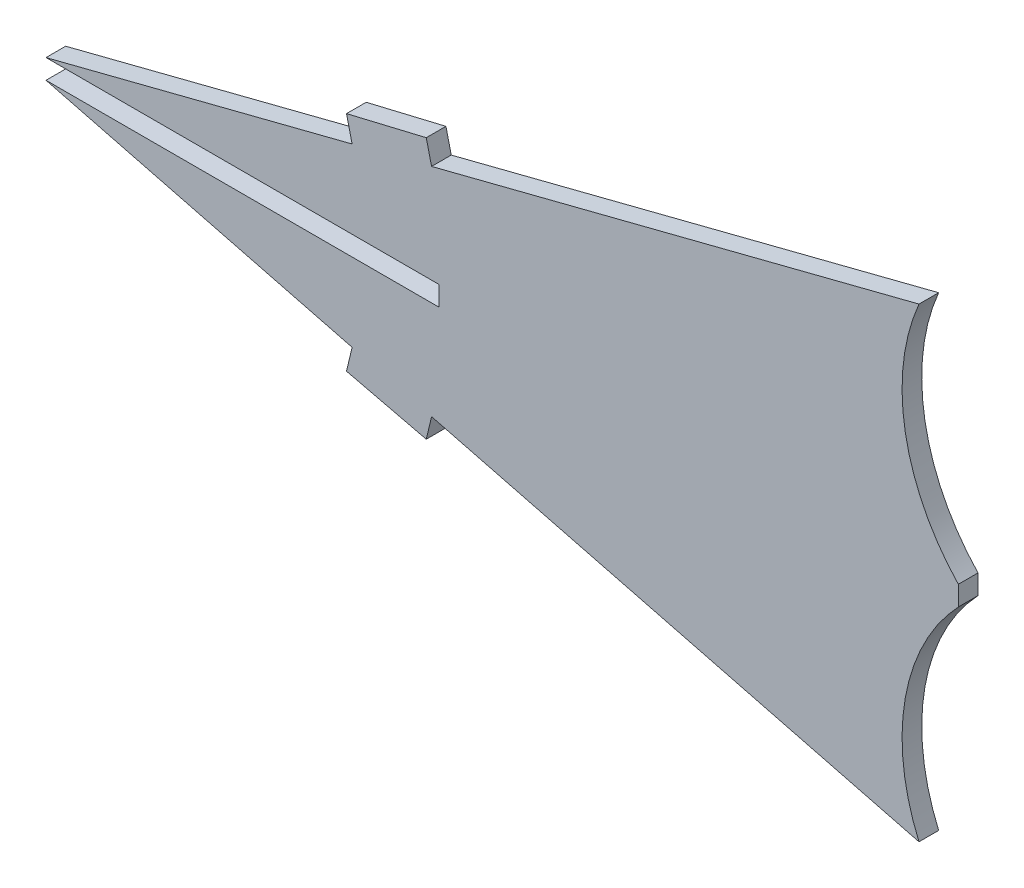
ISO-10303-21;
HEADER;
FILE_DESCRIPTION(('STEP AP214'),'2;1');
FILE_NAME('part.step','',(''),(''),'','','');
FILE_SCHEMA(('AUTOMOTIVE_DESIGN { 1 0 10303 214 1 1 1 1 }'));
ENDSEC;
DATA;
#1=APPLICATION_CONTEXT('core data for automotive mechanical design processes');
#2=APPLICATION_PROTOCOL_DEFINITION('international standard','automotive_design',2000,#1);
#3=PRODUCT_CONTEXT('',#1,'mechanical');
#4=PRODUCT('Part','Part','',(#3));
#5=PRODUCT_RELATED_PRODUCT_CATEGORY('part','',(#4));
#6=PRODUCT_DEFINITION_FORMATION('','',#4);
#7=PRODUCT_DEFINITION_CONTEXT('part definition',#1,'design');
#8=PRODUCT_DEFINITION('design','',#6,#7);
#9=PRODUCT_DEFINITION_SHAPE('','',#8);
#10=(LENGTH_UNIT() NAMED_UNIT(*) SI_UNIT(.MILLI.,.METRE.));
#11=(NAMED_UNIT(*) PLANE_ANGLE_UNIT() SI_UNIT($,.RADIAN.));
#12=(NAMED_UNIT(*) SI_UNIT($,.STERADIAN.) SOLID_ANGLE_UNIT());
#13=UNCERTAINTY_MEASURE_WITH_UNIT(LENGTH_MEASURE(1.E-05),#10,'distance_accuracy_value','');
#14=(GEOMETRIC_REPRESENTATION_CONTEXT(3) GLOBAL_UNCERTAINTY_ASSIGNED_CONTEXT((#13)) GLOBAL_UNIT_ASSIGNED_CONTEXT((#10,
#11,#12)) REPRESENTATION_CONTEXT('',''));
#15=CARTESIAN_POINT('',(0.,0.,0.));
#16=DIRECTION('',(0.,0.,1.));
#17=DIRECTION('',(1.,0.,0.));
#18=AXIS2_PLACEMENT_3D('',#15,#16,#17);
#19=CARTESIAN_POINT('',(119.605645903194,-1.52399999999689,1.524));
#20=DIRECTION('',(-1.02331121256464E-13,-1.,0.));
#21=DIRECTION('',(1.,-1.02331121256464E-13,0.));
#22=AXIS2_PLACEMENT_3D('',#19,#20,#21);
#23=PLANE('',#22);
#24=DIRECTION('',(-1.,1.02331121256464E-13,0.));
#25=VECTOR('',#24,1.);
#26=CARTESIAN_POINT('',(119.605645903194,-1.52399999999689,0.));
#27=LINE('',#26,#25);
#28=CARTESIAN_POINT('',(150.036715567802,-1.524,0.));
#29=VERTEX_POINT('',#28);
#30=CARTESIAN_POINT('',(119.605645903194,-1.52399999999689,0.));
#31=VERTEX_POINT('',#30);
#32=EDGE_CURVE('E185',#29,#31,#27,.T.);
#33=ORIENTED_EDGE('',*,*,#32,.T.);
#34=DIRECTION('',(0.,0.,-1.));
#35=VECTOR('',#34,1.);
#36=CARTESIAN_POINT('',(119.605645903194,-1.52399999999689,1.524));
#37=LINE('',#36,#35);
#38=CARTESIAN_POINT('',(119.605645903194,-1.52399999999689,1.524));
#39=VERTEX_POINT('',#38);
#40=EDGE_CURVE('E11',#39,#31,#37,.T.);
#41=ORIENTED_EDGE('',*,*,#40,.F.);
#42=DIRECTION('',(-1.,1.02331121256464E-13,0.));
#43=VECTOR('',#42,1.);
#44=CARTESIAN_POINT('',(119.605645903194,-1.52399999999689,1.524));
#45=LINE('',#44,#43);
#46=CARTESIAN_POINT('',(150.036715567802,-1.524,1.524));
#47=VERTEX_POINT('',#46);
#48=EDGE_CURVE('E215',#47,#39,#45,.T.);
#49=ORIENTED_EDGE('',*,*,#48,.F.);
#50=DIRECTION('',(0.,0.,-1.));
#51=VECTOR('',#50,1.);
#52=CARTESIAN_POINT('',(150.036715567802,-1.524,1.524));
#53=LINE('',#52,#51);
#54=EDGE_CURVE('E181',#47,#29,#53,.T.);
#55=ORIENTED_EDGE('',*,*,#54,.T.);
#56=EDGE_LOOP('',(#33,#41,#49,#55));
#57=FACE_BOUND('',#56,.T.);
#58=ADVANCED_FACE('F41',(#57),#23,.F.);
#59=CARTESIAN_POINT('',(119.605645903194,-1.52399999999689,1.524));
#60=DIRECTION('',(0.247516320191993,0.968883724312992,0.));
#61=DIRECTION('',(-0.968883724312993,0.247516320191993,0.));
#62=AXIS2_PLACEMENT_3D('',#59,#60,#61);
#63=PLANE('',#62);
#64=DIRECTION('',(0.968883724312993,-0.247516320191993,0.));
#65=VECTOR('',#64,1.);
#66=CARTESIAN_POINT('',(119.605645903194,-1.52399999999689,0.));
#67=LINE('',#66,#65);
#68=CARTESIAN_POINT('',(143.313878366168,-7.58063436203292,0.));
#69=VERTEX_POINT('',#68);
#70=EDGE_CURVE('E188',#31,#69,#67,.T.);
#71=ORIENTED_EDGE('',*,*,#70,.T.);
#72=DIRECTION('',(0.,0.,-1.));
#73=VECTOR('',#72,1.);
#74=CARTESIAN_POINT('',(143.313878366168,-7.58063436203292,1.524));
#75=LINE('',#74,#73);
#76=CARTESIAN_POINT('',(143.313878366168,-7.58063436203292,1.524));
#77=VERTEX_POINT('',#76);
#78=EDGE_CURVE('E49',#77,#69,#75,.T.);
#79=ORIENTED_EDGE('',*,*,#78,.F.);
#80=DIRECTION('',(0.968883724312993,-0.247516320191993,0.));
#81=VECTOR('',#80,1.);
#82=CARTESIAN_POINT('',(119.605645903194,-1.52399999999689,1.524));
#83=LINE('',#82,#81);
#84=EDGE_CURVE('E124',#39,#77,#83,.T.);
#85=ORIENTED_EDGE('',*,*,#84,.F.);
#86=ORIENTED_EDGE('',*,*,#40,.T.);
#87=EDGE_LOOP('',(#71,#79,#85,#86));
#88=FACE_BOUND('',#87,.T.);
#89=ADVANCED_FACE('F313',(#88),#63,.F.);
#90=CARTESIAN_POINT('',(143.313878366168,-7.58063436203292,1.524));
#91=DIRECTION('',(0.97269838476697,-0.232072946014238,0.));
#92=DIRECTION('',(0.232072946014238,0.97269838476697,0.));
#93=AXIS2_PLACEMENT_3D('',#90,#91,#92);
#94=PLANE('',#93);
#95=DIRECTION('',(-0.232072946014238,-0.97269838476697,0.));
#96=VECTOR('',#95,1.);
#97=CARTESIAN_POINT('',(143.313878366168,-7.58063436203292,0.));
#98=LINE('',#97,#96);
#99=CARTESIAN_POINT('',(142.879507780718,-9.40123247186798,0.));
#100=VERTEX_POINT('',#99);
#101=EDGE_CURVE('E190',#69,#100,#98,.T.);
#102=ORIENTED_EDGE('',*,*,#101,.T.);
#103=DIRECTION('',(0.,0.,-1.));
#104=VECTOR('',#103,1.);
#105=CARTESIAN_POINT('',(142.879507780718,-9.40123247186798,1.524));
#106=LINE('',#105,#104);
#107=CARTESIAN_POINT('',(142.879507780718,-9.40123247186798,1.524));
#108=VERTEX_POINT('',#107);
#109=EDGE_CURVE('E246',#108,#100,#106,.T.);
#110=ORIENTED_EDGE('',*,*,#109,.F.);
#111=DIRECTION('',(-0.232072946014238,-0.97269838476697,0.));
#112=VECTOR('',#111,1.);
#113=CARTESIAN_POINT('',(143.313878366168,-7.58063436203292,1.524));
#114=LINE('',#113,#112);
#115=EDGE_CURVE('E254',#77,#108,#114,.T.);
#116=ORIENTED_EDGE('',*,*,#115,.F.);
#117=ORIENTED_EDGE('',*,*,#78,.T.);
#118=EDGE_LOOP('',(#102,#110,#116,#117));
#119=FACE_BOUND('',#118,.T.);
#120=ADVANCED_FACE('F252',(#119),#94,.F.);
#121=CARTESIAN_POINT('',(142.879507780718,-9.40123247186798,1.524));
#122=DIRECTION('',(0.232072946014221,0.972698384766974,0.));
#123=DIRECTION('',(-0.972698384766974,0.232072946014221,0.));
#124=AXIS2_PLACEMENT_3D('',#121,#122,#123);
#125=PLANE('',#124);
#126=DIRECTION('',(0.972698384766974,-0.232072946014221,0.));
#127=VECTOR('',#126,1.);
#128=CARTESIAN_POINT('',(142.879507780718,-9.40123247186798,0.));
#129=LINE('',#128,#127);
#130=CARTESIAN_POINT('',(149.056142523988,-10.8748956790583,0.));
#131=VERTEX_POINT('',#130);
#132=EDGE_CURVE('E192',#100,#131,#129,.T.);
#133=ORIENTED_EDGE('',*,*,#132,.T.);
#134=DIRECTION('',(0.,0.,-1.));
#135=VECTOR('',#134,1.);
#136=CARTESIAN_POINT('',(149.056142523988,-10.8748956790583,1.524));
#137=LINE('',#136,#135);
#138=CARTESIAN_POINT('',(149.056142523988,-10.8748956790583,1.524));
#139=VERTEX_POINT('',#138);
#140=EDGE_CURVE('E243',#139,#131,#137,.T.);
#141=ORIENTED_EDGE('',*,*,#140,.F.);
#142=DIRECTION('',(0.972698384766974,-0.232072946014221,0.));
#143=VECTOR('',#142,1.);
#144=CARTESIAN_POINT('',(142.879507780718,-9.40123247186798,1.524));
#145=LINE('',#144,#143);
#146=EDGE_CURVE('E272',#108,#139,#145,.T.);
#147=ORIENTED_EDGE('',*,*,#146,.F.);
#148=ORIENTED_EDGE('',*,*,#109,.T.);
#149=EDGE_LOOP('',(#133,#141,#147,#148));
#150=FACE_BOUND('',#149,.T.);
#151=ADVANCED_FACE('F263',(#150),#125,.F.);
#152=CARTESIAN_POINT('',(149.467068546221,-9.15256188294182,1.524));
#153=DIRECTION('',(-0.97269838476698,0.232072946014198,0.));
#154=DIRECTION('',(-0.232072946014198,-0.97269838476698,0.));
#155=AXIS2_PLACEMENT_3D('',#152,#153,#154);
#156=PLANE('',#155);
#157=DIRECTION('',(0.232072946014198,0.97269838476698,0.));
#158=VECTOR('',#157,1.);
#159=CARTESIAN_POINT('',(149.467068546221,-9.15256188294182,0.));
#160=LINE('',#159,#158);
#161=CARTESIAN_POINT('',(149.467068546221,-9.15256188294182,0.));
#162=VERTEX_POINT('',#161);
#163=EDGE_CURVE('E194',#131,#162,#160,.T.);
#164=ORIENTED_EDGE('',*,*,#163,.T.);
#165=DIRECTION('',(0.,0.,-1.));
#166=VECTOR('',#165,1.);
#167=CARTESIAN_POINT('',(149.467068546221,-9.15256188294182,1.524));
#168=LINE('',#167,#166);
#169=CARTESIAN_POINT('',(149.467068546221,-9.15256188294182,1.524));
#170=VERTEX_POINT('',#169);
#171=EDGE_CURVE('E240',#170,#162,#168,.T.);
#172=ORIENTED_EDGE('',*,*,#171,.F.);
#173=DIRECTION('',(0.232072946014198,0.97269838476698,0.));
#174=VECTOR('',#173,1.);
#175=CARTESIAN_POINT('',(149.467068546221,-9.15256188294182,1.524));
#176=LINE('',#175,#174);
#177=EDGE_CURVE('E269',#139,#170,#176,.T.);
#178=ORIENTED_EDGE('',*,*,#177,.F.);
#179=ORIENTED_EDGE('',*,*,#140,.T.);
#180=EDGE_LOOP('',(#164,#172,#178,#179));
#181=FACE_BOUND('',#180,.T.);
#182=ADVANCED_FACE('F267',(#181),#156,.F.);
#183=CARTESIAN_POINT('',(149.467068546221,-9.15256188294182,1.524));
#184=DIRECTION('',(0.247516320191993,0.968883724312992,0.));
#185=DIRECTION('',(-0.968883724312993,0.247516320191993,0.));
#186=AXIS2_PLACEMENT_3D('',#183,#184,#185);
#187=PLANE('',#186);
#188=DIRECTION('',(0.968883724312993,-0.247516320191993,0.));
#189=VECTOR('',#188,1.);
#190=CARTESIAN_POINT('',(149.467068546221,-9.15256188294182,0.));
#191=LINE('',#190,#189);
#192=CARTESIAN_POINT('',(187.215425718064,-18.7959630734126,0.));
#193=VERTEX_POINT('',#192);
#194=EDGE_CURVE('E196',#162,#193,#191,.T.);
#195=ORIENTED_EDGE('',*,*,#194,.T.);
#196=DIRECTION('',(0.,0.,-1.));
#197=VECTOR('',#196,1.);
#198=CARTESIAN_POINT('',(187.215425718064,-18.7959630734126,1.524));
#199=LINE('',#198,#197);
#200=CARTESIAN_POINT('',(187.215425718064,-18.7959630734126,1.524));
#201=VERTEX_POINT('',#200);
#202=EDGE_CURVE('E237',#201,#193,#199,.T.);
#203=ORIENTED_EDGE('',*,*,#202,.F.);
#204=DIRECTION('',(0.968883724312993,-0.247516320191993,0.));
#205=VECTOR('',#204,1.);
#206=CARTESIAN_POINT('',(149.467068546221,-9.15256188294182,1.524));
#207=LINE('',#206,#205);
#208=EDGE_CURVE('E271',#170,#201,#207,.T.);
#209=ORIENTED_EDGE('',*,*,#208,.F.);
#210=ORIENTED_EDGE('',*,*,#171,.T.);
#211=EDGE_LOOP('',(#195,#203,#209,#210));
#212=FACE_BOUND('',#211,.T.);
#213=ADVANCED_FACE('F326',(#212),#187,.F.);
#214=CARTESIAN_POINT('',(201.830365874753,-12.4693533269423,1.524));
#215=DIRECTION('',(0.,0.,-1.));
#216=DIRECTION('',(-1.,0.,0.));
#217=AXIS2_PLACEMENT_3D('',#214,#215,#216);
#218=CYLINDRICAL_SURFACE('',#217,15.925528771998);
#219=CARTESIAN_POINT('',(201.830365874753,-12.4693533269423,0.));
#220=DIRECTION('',(0.,0.,-1.));
#221=DIRECTION('',(-1.,0.,0.));
#222=AXIS2_PLACEMENT_3D('',#219,#220,#221);
#223=CIRCLE('',#222,15.925528771998);
#224=CARTESIAN_POINT('',(190.26223261065,-1.52399999999689,0.));
#225=VERTEX_POINT('',#224);
#226=EDGE_CURVE('E198',#193,#225,#223,.T.);
#227=ORIENTED_EDGE('',*,*,#226,.T.);
#228=DIRECTION('',(0.,0.,-1.));
#229=VECTOR('',#228,1.);
#230=CARTESIAN_POINT('',(190.26223261065,-1.52399999999689,1.524));
#231=LINE('',#230,#229);
#232=CARTESIAN_POINT('',(190.26223261065,-1.52399999999689,1.524));
#233=VERTEX_POINT('',#232);
#234=EDGE_CURVE('E234',#233,#225,#231,.T.);
#235=ORIENTED_EDGE('',*,*,#234,.F.);
#236=CARTESIAN_POINT('',(201.830365874753,-12.4693533269423,1.524));
#237=DIRECTION('',(0.,0.,-1.));
#238=DIRECTION('',(-1.,0.,0.));
#239=AXIS2_PLACEMENT_3D('',#236,#237,#238);
#240=CIRCLE('',#239,15.925528771998);
#241=EDGE_CURVE('E274',#201,#233,#240,.T.);
#242=ORIENTED_EDGE('',*,*,#241,.F.);
#243=ORIENTED_EDGE('',*,*,#202,.T.);
#244=EDGE_LOOP('',(#227,#235,#242,#243));
#245=FACE_BOUND('',#244,.T.);
#246=ADVANCED_FACE('F329',(#245),#218,.F.);
#247=CARTESIAN_POINT('',(190.26223261065,0.,1.524));
#248=DIRECTION('',(-1.,0.,0.));
#249=DIRECTION('',(0.,0.,1.));
#250=AXIS2_PLACEMENT_3D('',#247,#248,#249);
#251=PLANE('',#250);
#252=DIRECTION('',(0.,1.,0.));
#253=VECTOR('',#252,1.);
#254=CARTESIAN_POINT('',(190.26223261065,0.,0.));
#255=LINE('',#254,#253);
#256=CARTESIAN_POINT('',(190.26223261065,0.,0.));
#257=VERTEX_POINT('',#256);
#258=EDGE_CURVE('E200',#225,#257,#255,.T.);
#259=ORIENTED_EDGE('',*,*,#258,.T.);
#260=DIRECTION('',(0.,0.,-1.));
#261=VECTOR('',#260,1.);
#262=CARTESIAN_POINT('',(190.26223261065,0.,1.524));
#263=LINE('',#262,#261);
#264=CARTESIAN_POINT('',(190.26223261065,0.,1.524));
#265=VERTEX_POINT('',#264);
#266=EDGE_CURVE('E231',#265,#257,#263,.T.);
#267=ORIENTED_EDGE('',*,*,#266,.F.);
#268=DIRECTION('',(0.,1.,0.));
#269=VECTOR('',#268,1.);
#270=CARTESIAN_POINT('',(190.26223261065,0.,1.524));
#271=LINE('',#270,#269);
#272=EDGE_CURVE('E280',#233,#265,#271,.T.);
#273=ORIENTED_EDGE('',*,*,#272,.F.);
#274=ORIENTED_EDGE('',*,*,#234,.T.);
#275=EDGE_LOOP('',(#259,#267,#273,#274));
#276=FACE_BOUND('',#275,.T.);
#277=ADVANCED_FACE('F333',(#276),#251,.F.);
#278=CARTESIAN_POINT('',(201.830365874754,10.9453533269456,1.524));
#279=DIRECTION('',(0.,0.,-1.));
#280=DIRECTION('',(-1.,0.,0.));
#281=AXIS2_PLACEMENT_3D('',#278,#279,#280);
#282=CYLINDRICAL_SURFACE('',#281,15.9255287719985);
#283=CARTESIAN_POINT('',(201.830365874754,10.9453533269456,0.));
#284=DIRECTION('',(0.,0.,-1.));
#285=DIRECTION('',(1.,0.,0.));
#286=AXIS2_PLACEMENT_3D('',#283,#284,#285);
#287=CIRCLE('',#286,15.9255287719985);
#288=CARTESIAN_POINT('',(187.215425718064,17.2719630734158,0.));
#289=VERTEX_POINT('',#288);
#290=EDGE_CURVE('E202',#257,#289,#287,.T.);
#291=ORIENTED_EDGE('',*,*,#290,.T.);
#292=DIRECTION('',(0.,0.,-1.));
#293=VECTOR('',#292,1.);
#294=CARTESIAN_POINT('',(187.215425718064,17.2719630734158,1.524));
#295=LINE('',#294,#293);
#296=CARTESIAN_POINT('',(187.215425718064,17.2719630734158,1.524));
#297=VERTEX_POINT('',#296);
#298=EDGE_CURVE('E228',#297,#289,#295,.T.);
#299=ORIENTED_EDGE('',*,*,#298,.F.);
#300=CARTESIAN_POINT('',(201.830365874754,10.9453533269456,1.524));
#301=DIRECTION('',(0.,0.,-1.));
#302=DIRECTION('',(1.,0.,0.));
#303=AXIS2_PLACEMENT_3D('',#300,#301,#302);
#304=CIRCLE('',#303,15.9255287719985);
#305=EDGE_CURVE('E282',#265,#297,#304,.T.);
#306=ORIENTED_EDGE('',*,*,#305,.F.);
#307=ORIENTED_EDGE('',*,*,#266,.T.);
#308=EDGE_LOOP('',(#291,#299,#306,#307));
#309=FACE_BOUND('',#308,.T.);
#310=ADVANCED_FACE('F337',(#309),#282,.F.);
#311=CARTESIAN_POINT('',(149.467068546221,7.62856188294507,1.524));
#312=DIRECTION('',(0.247516320191993,-0.968883724312992,0.));
#313=DIRECTION('',(0.968883724312993,0.247516320191993,0.));
#314=AXIS2_PLACEMENT_3D('',#311,#312,#313);
#315=PLANE('',#314);
#316=DIRECTION('',(-0.968883724312993,-0.247516320191993,0.));
#317=VECTOR('',#316,1.);
#318=CARTESIAN_POINT('',(149.467068546221,7.62856188294507,0.));
#319=LINE('',#318,#317);
#320=CARTESIAN_POINT('',(149.467068546221,7.62856188294507,0.));
#321=VERTEX_POINT('',#320);
#322=EDGE_CURVE('E204',#289,#321,#319,.T.);
#323=ORIENTED_EDGE('',*,*,#322,.T.);
#324=DIRECTION('',(0.,0.,-1.));
#325=VECTOR('',#324,1.);
#326=CARTESIAN_POINT('',(149.467068546221,7.62856188294507,1.524));
#327=LINE('',#326,#325);
#328=CARTESIAN_POINT('',(149.467068546221,7.62856188294507,1.524));
#329=VERTEX_POINT('',#328);
#330=EDGE_CURVE('E225',#329,#321,#327,.T.);
#331=ORIENTED_EDGE('',*,*,#330,.F.);
#332=DIRECTION('',(-0.968883724312993,-0.247516320191993,0.));
#333=VECTOR('',#332,1.);
#334=CARTESIAN_POINT('',(149.467068546221,7.62856188294507,1.524));
#335=LINE('',#334,#333);
#336=EDGE_CURVE('E284',#297,#329,#335,.T.);
#337=ORIENTED_EDGE('',*,*,#336,.F.);
#338=ORIENTED_EDGE('',*,*,#298,.T.);
#339=EDGE_LOOP('',(#323,#331,#337,#338));
#340=FACE_BOUND('',#339,.T.);
#341=ADVANCED_FACE('F341',(#340),#315,.F.);
#342=CARTESIAN_POINT('',(149.467068546221,7.62856188294507,1.524));
#343=DIRECTION('',(-0.972698384766968,-0.232072946014247,0.));
#344=DIRECTION('',(0.232072946014247,-0.972698384766968,0.));
#345=AXIS2_PLACEMENT_3D('',#342,#343,#344);
#346=PLANE('',#345);
#347=DIRECTION('',(-0.232072946014247,0.972698384766968,0.));
#348=VECTOR('',#347,1.);
#349=CARTESIAN_POINT('',(149.467068546221,7.62856188294507,0.));
#350=LINE('',#349,#348);
#351=CARTESIAN_POINT('',(149.056142523988,9.3508956790614,0.));
#352=VERTEX_POINT('',#351);
#353=EDGE_CURVE('E206',#321,#352,#350,.T.);
#354=ORIENTED_EDGE('',*,*,#353,.T.);
#355=DIRECTION('',(0.,0.,-1.));
#356=VECTOR('',#355,1.);
#357=CARTESIAN_POINT('',(149.056142523988,9.3508956790614,1.524));
#358=LINE('',#357,#356);
#359=CARTESIAN_POINT('',(149.056142523988,9.3508956790614,1.524));
#360=VERTEX_POINT('',#359);
#361=EDGE_CURVE('E222',#360,#352,#358,.T.);
#362=ORIENTED_EDGE('',*,*,#361,.F.);
#363=DIRECTION('',(-0.232072946014247,0.972698384766968,0.));
#364=VECTOR('',#363,1.);
#365=CARTESIAN_POINT('',(149.467068546221,7.62856188294507,1.524));
#366=LINE('',#365,#364);
#367=EDGE_CURVE('E286',#329,#360,#366,.T.);
#368=ORIENTED_EDGE('',*,*,#367,.F.);
#369=ORIENTED_EDGE('',*,*,#330,.T.);
#370=EDGE_LOOP('',(#354,#362,#368,#369));
#371=FACE_BOUND('',#370,.T.);
#372=ADVANCED_FACE('F345',(#371),#346,.F.);
#373=CARTESIAN_POINT('',(142.879507780718,7.87723247187109,1.524));
#374=DIRECTION('',(0.232072946014222,-0.972698384766974,0.));
#375=DIRECTION('',(0.972698384766974,0.232072946014222,0.));
#376=AXIS2_PLACEMENT_3D('',#373,#374,#375);
#377=PLANE('',#376);
#378=DIRECTION('',(-0.972698384766974,-0.232072946014222,0.));
#379=VECTOR('',#378,1.);
#380=CARTESIAN_POINT('',(142.879507780718,7.87723247187109,0.));
#381=LINE('',#380,#379);
#382=CARTESIAN_POINT('',(142.879507780718,7.87723247187109,0.));
#383=VERTEX_POINT('',#382);
#384=EDGE_CURVE('E208',#352,#383,#381,.T.);
#385=ORIENTED_EDGE('',*,*,#384,.T.);
#386=DIRECTION('',(0.,0.,-1.));
#387=VECTOR('',#386,1.);
#388=CARTESIAN_POINT('',(142.879507780718,7.87723247187109,1.524));
#389=LINE('',#388,#387);
#390=CARTESIAN_POINT('',(142.879507780718,7.87723247187109,1.524));
#391=VERTEX_POINT('',#390);
#392=EDGE_CURVE('E219',#391,#383,#389,.T.);
#393=ORIENTED_EDGE('',*,*,#392,.F.);
#394=DIRECTION('',(-0.972698384766974,-0.232072946014222,0.));
#395=VECTOR('',#394,1.);
#396=CARTESIAN_POINT('',(142.879507780718,7.87723247187109,1.524));
#397=LINE('',#396,#395);
#398=EDGE_CURVE('E288',#360,#391,#397,.T.);
#399=ORIENTED_EDGE('',*,*,#398,.F.);
#400=ORIENTED_EDGE('',*,*,#361,.T.);
#401=EDGE_LOOP('',(#385,#393,#399,#400));
#402=FACE_BOUND('',#401,.T.);
#403=ADVANCED_FACE('F294',(#402),#377,.F.);
#404=CARTESIAN_POINT('',(143.313878366168,6.05663436203603,1.524));
#405=DIRECTION('',(0.97269838476697,0.232072946014238,0.));
#406=DIRECTION('',(-0.232072946014238,0.97269838476697,0.));
#407=AXIS2_PLACEMENT_3D('',#404,#405,#406);
#408=PLANE('',#407);
#409=DIRECTION('',(0.232072946014238,-0.97269838476697,0.));
#410=VECTOR('',#409,1.);
#411=CARTESIAN_POINT('',(143.313878366168,6.05663436203603,0.));
#412=LINE('',#411,#410);
#413=CARTESIAN_POINT('',(143.313878366168,6.05663436203603,0.));
#414=VERTEX_POINT('',#413);
#415=EDGE_CURVE('E210',#383,#414,#412,.T.);
#416=ORIENTED_EDGE('',*,*,#415,.T.);
#417=DIRECTION('',(0.,0.,-1.));
#418=VECTOR('',#417,1.);
#419=CARTESIAN_POINT('',(143.313878366168,6.05663436203603,1.524));
#420=LINE('',#419,#418);
#421=CARTESIAN_POINT('',(143.313878366168,6.05663436203603,1.524));
#422=VERTEX_POINT('',#421);
#423=EDGE_CURVE('E176',#422,#414,#420,.T.);
#424=ORIENTED_EDGE('',*,*,#423,.F.);
#425=DIRECTION('',(0.232072946014238,-0.97269838476697,0.));
#426=VECTOR('',#425,1.);
#427=CARTESIAN_POINT('',(143.313878366168,6.05663436203603,1.524));
#428=LINE('',#427,#426);
#429=EDGE_CURVE('E167',#391,#422,#428,.T.);
#430=ORIENTED_EDGE('',*,*,#429,.F.);
#431=ORIENTED_EDGE('',*,*,#392,.T.);
#432=EDGE_LOOP('',(#416,#424,#430,#431));
#433=FACE_BOUND('',#432,.T.);
#434=ADVANCED_FACE('F298',(#433),#408,.F.);
#435=CARTESIAN_POINT('',(119.605645903194,0.,1.524));
#436=DIRECTION('',(0.247516320191993,-0.968883724312992,0.));
#437=DIRECTION('',(0.968883724312993,0.247516320191993,0.));
#438=AXIS2_PLACEMENT_3D('',#435,#436,#437);
#439=PLANE('',#438);
#440=DIRECTION('',(-0.968883724312993,-0.247516320191993,0.));
#441=VECTOR('',#440,1.);
#442=CARTESIAN_POINT('',(119.605645903194,0.,0.));
#443=LINE('',#442,#441);
#444=CARTESIAN_POINT('',(119.605645903194,0.,0.));
#445=VERTEX_POINT('',#444);
#446=EDGE_CURVE('E175',#414,#445,#443,.T.);
#447=ORIENTED_EDGE('',*,*,#446,.T.);
#448=DIRECTION('',(0.,0.,-1.));
#449=VECTOR('',#448,1.);
#450=CARTESIAN_POINT('',(119.605645903194,0.,1.524));
#451=LINE('',#450,#449);
#452=CARTESIAN_POINT('',(119.605645903194,0.,1.524));
#453=VERTEX_POINT('',#452);
#454=EDGE_CURVE('E172',#453,#445,#451,.T.);
#455=ORIENTED_EDGE('',*,*,#454,.F.);
#456=DIRECTION('',(-0.968883724312993,-0.247516320191993,0.));
#457=VECTOR('',#456,1.);
#458=CARTESIAN_POINT('',(119.605645903194,0.,1.524));
#459=LINE('',#458,#457);
#460=EDGE_CURVE('E161',#422,#453,#459,.T.);
#461=ORIENTED_EDGE('',*,*,#460,.F.);
#462=ORIENTED_EDGE('',*,*,#423,.T.);
#463=EDGE_LOOP('',(#447,#455,#461,#462));
#464=FACE_BOUND('',#463,.T.);
#465=ADVANCED_FACE('F173',(#464),#439,.F.);
#466=CARTESIAN_POINT('',(119.605645903194,0.,1.524));
#467=DIRECTION('',(0.,1.,0.));
#468=DIRECTION('',(0.,0.,1.));
#469=AXIS2_PLACEMENT_3D('',#466,#467,#468);
#470=PLANE('',#469);
#471=DIRECTION('',(1.,0.,0.));
#472=VECTOR('',#471,1.);
#473=CARTESIAN_POINT('',(119.605645903194,0.,0.));
#474=LINE('',#473,#472);
#475=CARTESIAN_POINT('',(150.036715567802,0.,0.));
#476=VERTEX_POINT('',#475);
#477=EDGE_CURVE('E110',#445,#476,#474,.T.);
#478=ORIENTED_EDGE('',*,*,#477,.T.);
#479=DIRECTION('',(0.,0.,-1.));
#480=VECTOR('',#479,1.);
#481=CARTESIAN_POINT('',(150.036715567802,0.,1.524));
#482=LINE('',#481,#480);
#483=CARTESIAN_POINT('',(150.036715567802,0.,1.524));
#484=VERTEX_POINT('',#483);
#485=EDGE_CURVE('E177',#484,#476,#482,.T.);
#486=ORIENTED_EDGE('',*,*,#485,.F.);
#487=DIRECTION('',(1.,0.,0.));
#488=VECTOR('',#487,1.);
#489=CARTESIAN_POINT('',(119.605645903194,0.,1.524));
#490=LINE('',#489,#488);
#491=EDGE_CURVE('E165',#453,#484,#490,.T.);
#492=ORIENTED_EDGE('',*,*,#491,.F.);
#493=ORIENTED_EDGE('',*,*,#454,.T.);
#494=EDGE_LOOP('',(#478,#486,#492,#493));
#495=FACE_BOUND('',#494,.T.);
#496=ADVANCED_FACE('F179',(#495),#470,.F.);
#497=CARTESIAN_POINT('',(150.036715567802,-1.524,1.524));
#498=DIRECTION('',(1.,0.,0.));
#499=DIRECTION('',(0.,0.,-1.));
#500=AXIS2_PLACEMENT_3D('',#497,#498,#499);
#501=PLANE('',#500);
#502=DIRECTION('',(0.,-1.,0.));
#503=VECTOR('',#502,1.);
#504=CARTESIAN_POINT('',(150.036715567802,-1.524,0.));
#505=LINE('',#504,#503);
#506=EDGE_CURVE('E116',#476,#29,#505,.T.);
#507=ORIENTED_EDGE('',*,*,#506,.T.);
#508=ORIENTED_EDGE('',*,*,#54,.F.);
#509=DIRECTION('',(0.,-1.,0.));
#510=VECTOR('',#509,1.);
#511=CARTESIAN_POINT('',(150.036715567802,-1.524,1.524));
#512=LINE('',#511,#510);
#513=EDGE_CURVE('E57',#484,#47,#512,.T.);
#514=ORIENTED_EDGE('',*,*,#513,.F.);
#515=ORIENTED_EDGE('',*,*,#485,.T.);
#516=EDGE_LOOP('',(#507,#508,#514,#515));
#517=FACE_BOUND('',#516,.T.);
#518=ADVANCED_FACE('F302',(#517),#501,.F.);
#519=CARTESIAN_POINT('',(201.830365874754,10.9453533269456,1.524));
#520=DIRECTION('',(0.,0.,1.));
#521=DIRECTION('',(1.,0.,0.));
#522=AXIS2_PLACEMENT_3D('',#519,#520,#521);
#523=PLANE('',#522);
#524=ORIENTED_EDGE('',*,*,#48,.T.);
#525=ORIENTED_EDGE('',*,*,#84,.T.);
#526=ORIENTED_EDGE('',*,*,#115,.T.);
#527=ORIENTED_EDGE('',*,*,#146,.T.);
#528=ORIENTED_EDGE('',*,*,#177,.T.);
#529=ORIENTED_EDGE('',*,*,#208,.T.);
#530=ORIENTED_EDGE('',*,*,#241,.T.);
#531=ORIENTED_EDGE('',*,*,#272,.T.);
#532=ORIENTED_EDGE('',*,*,#305,.T.);
#533=ORIENTED_EDGE('',*,*,#336,.T.);
#534=ORIENTED_EDGE('',*,*,#367,.T.);
#535=ORIENTED_EDGE('',*,*,#398,.T.);
#536=ORIENTED_EDGE('',*,*,#429,.T.);
#537=ORIENTED_EDGE('',*,*,#460,.T.);
#538=ORIENTED_EDGE('',*,*,#491,.T.);
#539=ORIENTED_EDGE('',*,*,#513,.T.);
#540=EDGE_LOOP('',(#524,#525,#526,#527,#528,#529,#530,#531,#532,#533,#534,#535,#536,#537,#538,#539));
#541=FACE_BOUND('',#540,.T.);
#542=ADVANCED_FACE('F163',(#541),#523,.T.);
#543=CARTESIAN_POINT('',(201.830365874754,10.9453533269456,0.));
#544=DIRECTION('',(0.,0.,1.));
#545=DIRECTION('',(1.,0.,0.));
#546=AXIS2_PLACEMENT_3D('',#543,#544,#545);
#547=PLANE('',#546);
#548=ORIENTED_EDGE('',*,*,#32,.F.);
#549=ORIENTED_EDGE('',*,*,#506,.F.);
#550=ORIENTED_EDGE('',*,*,#477,.F.);
#551=ORIENTED_EDGE('',*,*,#446,.F.);
#552=ORIENTED_EDGE('',*,*,#415,.F.);
#553=ORIENTED_EDGE('',*,*,#384,.F.);
#554=ORIENTED_EDGE('',*,*,#353,.F.);
#555=ORIENTED_EDGE('',*,*,#322,.F.);
#556=ORIENTED_EDGE('',*,*,#290,.F.);
#557=ORIENTED_EDGE('',*,*,#258,.F.);
#558=ORIENTED_EDGE('',*,*,#226,.F.);
#559=ORIENTED_EDGE('',*,*,#194,.F.);
#560=ORIENTED_EDGE('',*,*,#163,.F.);
#561=ORIENTED_EDGE('',*,*,#132,.F.);
#562=ORIENTED_EDGE('',*,*,#101,.F.);
#563=ORIENTED_EDGE('',*,*,#70,.F.);
#564=EDGE_LOOP('',(#548,#549,#550,#551,#552,#553,#554,#555,#556,#557,#558,#559,#560,#561,#562,#563));
#565=FACE_BOUND('',#564,.T.);
#566=ADVANCED_FACE('F258',(#565),#547,.F.);
#567=CLOSED_SHELL('',(#58,#89,#120,#151,#182,#213,#246,#277,#310,#341,#372,#403,#434,#465,#496,
#518,#542,#566));
#568=MANIFOLD_SOLID_BREP('B2',#567);
#569=ADVANCED_BREP_SHAPE_REPRESENTATION('',(#18,#568),#14);
#570=SHAPE_DEFINITION_REPRESENTATION(#9,#569);
ENDSEC;
END-ISO-10303-21;
